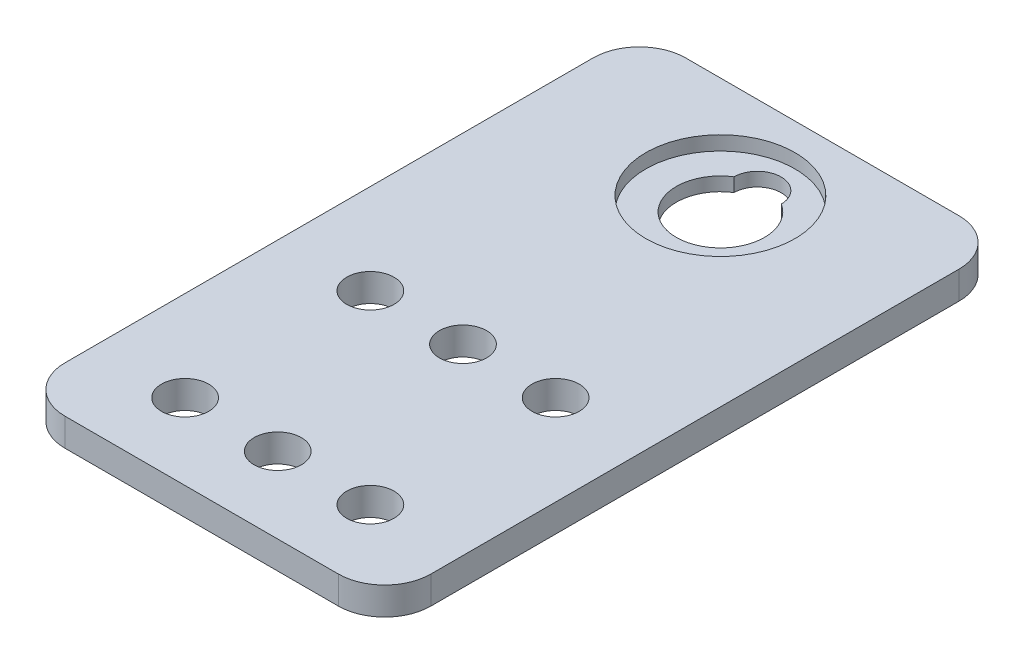
ISO-10303-21;
HEADER;
FILE_DESCRIPTION(('STEP AP214'),'2;1');
FILE_NAME('part.step','',(''),(''),'','','');
FILE_SCHEMA(('AUTOMOTIVE_DESIGN { 1 0 10303 214 1 1 1 1 }'));
ENDSEC;
DATA;
#1=APPLICATION_CONTEXT('core data for automotive mechanical design processes');
#2=APPLICATION_PROTOCOL_DEFINITION('international standard','automotive_design',2000,#1);
#3=PRODUCT_CONTEXT('',#1,'mechanical');
#4=PRODUCT('Part','Part','',(#3));
#5=PRODUCT_RELATED_PRODUCT_CATEGORY('part','',(#4));
#6=PRODUCT_DEFINITION_FORMATION('','',#4);
#7=PRODUCT_DEFINITION_CONTEXT('part definition',#1,'design');
#8=PRODUCT_DEFINITION('design','',#6,#7);
#9=PRODUCT_DEFINITION_SHAPE('','',#8);
#10=(LENGTH_UNIT() NAMED_UNIT(*) SI_UNIT(.MILLI.,.METRE.));
#11=(NAMED_UNIT(*) PLANE_ANGLE_UNIT() SI_UNIT($,.RADIAN.));
#12=(NAMED_UNIT(*) SI_UNIT($,.STERADIAN.) SOLID_ANGLE_UNIT());
#13=UNCERTAINTY_MEASURE_WITH_UNIT(LENGTH_MEASURE(1.E-05),#10,'distance_accuracy_value','');
#14=(GEOMETRIC_REPRESENTATION_CONTEXT(3) GLOBAL_UNCERTAINTY_ASSIGNED_CONTEXT((#13)) GLOBAL_UNIT_ASSIGNED_CONTEXT((#10,
#11,#12)) REPRESENTATION_CONTEXT('',''));
#15=CARTESIAN_POINT('',(0.,0.,0.));
#16=DIRECTION('',(0.,0.,1.));
#17=DIRECTION('',(1.,0.,0.));
#18=AXIS2_PLACEMENT_3D('',#15,#16,#17);
#19=CARTESIAN_POINT('',(-14.75,3.,28.5));
#20=DIRECTION('',(0.,-1.,0.));
#21=DIRECTION('',(0.,0.,-1.));
#22=AXIS2_PLACEMENT_3D('',#19,#20,#21);
#23=PLANE('',#22);
#24=CARTESIAN_POINT('',(0.,3.,-22.5));
#25=DIRECTION('',(0.,1.,0.));
#26=DIRECTION('',(0.,0.,1.));
#27=AXIS2_PLACEMENT_3D('',#24,#25,#26);
#28=CIRCLE('',#27,8.0518);
#29=CARTESIAN_POINT('',(0.,3.,-14.4482));
#30=VERTEX_POINT('',#29);
#31=EDGE_CURVE('E454',#30,#30,#28,.T.);
#32=ORIENTED_EDGE('',*,*,#31,.F.);
#33=EDGE_LOOP('',(#32));
#34=FACE_BOUND('',#33,.T.);
#35=CARTESIAN_POINT('',(-14.75,3.,28.5));
#36=DIRECTION('',(0.,1.,0.));
#37=DIRECTION('',(0.,0.,-1.));
#38=AXIS2_PLACEMENT_3D('',#35,#36,#37);
#39=CIRCLE('',#38,5.);
#40=CARTESIAN_POINT('',(-19.75,3.,28.5));
#41=VERTEX_POINT('',#40);
#42=CARTESIAN_POINT('',(-14.75,3.,33.5));
#43=VERTEX_POINT('',#42);
#44=EDGE_CURVE('E172',#41,#43,#39,.T.);
#45=ORIENTED_EDGE('',*,*,#44,.T.);
#46=DIRECTION('',(1.,0.,0.));
#47=VECTOR('',#46,1.);
#48=CARTESIAN_POINT('',(14.75,3.,33.5));
#49=LINE('',#48,#47);
#50=CARTESIAN_POINT('',(14.75,3.,33.5));
#51=VERTEX_POINT('',#50);
#52=EDGE_CURVE('E113',#43,#51,#49,.T.);
#53=ORIENTED_EDGE('',*,*,#52,.T.);
#54=CARTESIAN_POINT('',(14.75,3.,28.5));
#55=DIRECTION('',(0.,1.,0.));
#56=DIRECTION('',(0.,0.,1.));
#57=AXIS2_PLACEMENT_3D('',#54,#55,#56);
#58=CIRCLE('',#57,5.00000000000001);
#59=CARTESIAN_POINT('',(19.75,3.,28.5));
#60=VERTEX_POINT('',#59);
#61=EDGE_CURVE('E252',#51,#60,#58,.T.);
#62=ORIENTED_EDGE('',*,*,#61,.T.);
#63=DIRECTION('',(0.,0.,-1.));
#64=VECTOR('',#63,1.);
#65=CARTESIAN_POINT('',(19.75,3.,28.5));
#66=LINE('',#65,#64);
#67=CARTESIAN_POINT('',(19.75,3.,-28.5));
#68=VERTEX_POINT('',#67);
#69=EDGE_CURVE('E254',#60,#68,#66,.T.);
#70=ORIENTED_EDGE('',*,*,#69,.T.);
#71=CARTESIAN_POINT('',(14.75,3.,-28.5));
#72=DIRECTION('',(0.,1.,0.));
#73=DIRECTION('',(0.,0.,1.));
#74=AXIS2_PLACEMENT_3D('',#71,#72,#73);
#75=CIRCLE('',#74,5.);
#76=CARTESIAN_POINT('',(14.75,3.,-33.5));
#77=VERTEX_POINT('',#76);
#78=EDGE_CURVE('E135',#68,#77,#75,.T.);
#79=ORIENTED_EDGE('',*,*,#78,.T.);
#80=DIRECTION('',(-1.,0.,0.));
#81=VECTOR('',#80,1.);
#82=CARTESIAN_POINT('',(14.75,3.,-33.5));
#83=LINE('',#82,#81);
#84=CARTESIAN_POINT('',(-14.75,3.,-33.5));
#85=VERTEX_POINT('',#84);
#86=EDGE_CURVE('E128',#77,#85,#83,.T.);
#87=ORIENTED_EDGE('',*,*,#86,.T.);
#88=CARTESIAN_POINT('',(-14.75,3.,-28.5));
#89=DIRECTION('',(0.,1.,0.));
#90=DIRECTION('',(0.,0.,1.));
#91=AXIS2_PLACEMENT_3D('',#88,#89,#90);
#92=CIRCLE('',#91,5.);
#93=CARTESIAN_POINT('',(-19.75,3.,-28.5));
#94=VERTEX_POINT('',#93);
#95=EDGE_CURVE('E132',#85,#94,#92,.T.);
#96=ORIENTED_EDGE('',*,*,#95,.T.);
#97=DIRECTION('',(0.,0.,1.));
#98=VECTOR('',#97,1.);
#99=CARTESIAN_POINT('',(-19.75,3.,28.5));
#100=LINE('',#99,#98);
#101=EDGE_CURVE('E71',#94,#41,#100,.T.);
#102=ORIENTED_EDGE('',*,*,#101,.T.);
#103=EDGE_LOOP('',(#45,#53,#62,#70,#79,#87,#96,#102));
#104=FACE_BOUND('',#103,.T.);
#105=CARTESIAN_POINT('',(10.,3.,25.29));
#106=DIRECTION('',(0.,1.,0.));
#107=DIRECTION('',(0.,0.,1.));
#108=AXIS2_PLACEMENT_3D('',#105,#106,#107);
#109=CIRCLE('',#108,2.55);
#110=CARTESIAN_POINT('',(10.,3.,27.84));
#111=VERTEX_POINT('',#110);
#112=EDGE_CURVE('E244',#111,#111,#109,.T.);
#113=ORIENTED_EDGE('',*,*,#112,.F.);
#114=EDGE_LOOP('',(#113));
#115=FACE_BOUND('',#114,.T.);
#116=CARTESIAN_POINT('',(10.,3.,5.29));
#117=DIRECTION('',(0.,1.,0.));
#118=DIRECTION('',(0.,0.,1.));
#119=AXIS2_PLACEMENT_3D('',#116,#117,#118);
#120=CIRCLE('',#119,2.55);
#121=CARTESIAN_POINT('',(10.,3.,7.84));
#122=VERTEX_POINT('',#121);
#123=EDGE_CURVE('E238',#122,#122,#120,.T.);
#124=ORIENTED_EDGE('',*,*,#123,.F.);
#125=EDGE_LOOP('',(#124));
#126=FACE_BOUND('',#125,.T.);
#127=CARTESIAN_POINT('',(0.,3.,25.29));
#128=DIRECTION('',(0.,1.,0.));
#129=DIRECTION('',(0.,0.,1.));
#130=AXIS2_PLACEMENT_3D('',#127,#128,#129);
#131=CIRCLE('',#130,2.55);
#132=CARTESIAN_POINT('',(0.,3.,27.84));
#133=VERTEX_POINT('',#132);
#134=EDGE_CURVE('E232',#133,#133,#131,.T.);
#135=ORIENTED_EDGE('',*,*,#134,.F.);
#136=EDGE_LOOP('',(#135));
#137=FACE_BOUND('',#136,.T.);
#138=CARTESIAN_POINT('',(0.,3.,5.29));
#139=DIRECTION('',(0.,1.,0.));
#140=DIRECTION('',(0.,0.,1.));
#141=AXIS2_PLACEMENT_3D('',#138,#139,#140);
#142=CIRCLE('',#141,2.55);
#143=CARTESIAN_POINT('',(0.,3.,7.84));
#144=VERTEX_POINT('',#143);
#145=EDGE_CURVE('E226',#144,#144,#142,.T.);
#146=ORIENTED_EDGE('',*,*,#145,.F.);
#147=EDGE_LOOP('',(#146));
#148=FACE_BOUND('',#147,.T.);
#149=CARTESIAN_POINT('',(-9.99999999999999,3.,25.29));
#150=DIRECTION('',(0.,1.,0.));
#151=DIRECTION('',(0.,0.,1.));
#152=AXIS2_PLACEMENT_3D('',#149,#150,#151);
#153=CIRCLE('',#152,2.55);
#154=CARTESIAN_POINT('',(-9.99999999999999,3.,27.84));
#155=VERTEX_POINT('',#154);
#156=EDGE_CURVE('E220',#155,#155,#153,.T.);
#157=ORIENTED_EDGE('',*,*,#156,.F.);
#158=EDGE_LOOP('',(#157));
#159=FACE_BOUND('',#158,.T.);
#160=CARTESIAN_POINT('',(-9.99999999999999,3.,5.29));
#161=DIRECTION('',(0.,1.,0.));
#162=DIRECTION('',(0.,0.,1.));
#163=AXIS2_PLACEMENT_3D('',#160,#161,#162);
#164=CIRCLE('',#163,2.55);
#165=CARTESIAN_POINT('',(-9.99999999999999,3.,7.84));
#166=VERTEX_POINT('',#165);
#167=EDGE_CURVE('E211',#166,#166,#164,.T.);
#168=ORIENTED_EDGE('',*,*,#167,.F.);
#169=EDGE_LOOP('',(#168));
#170=FACE_BOUND('',#169,.T.);
#171=ADVANCED_FACE('F48',(#34,#104,#115,#126,#137,#148,#159,#170),#23,.F.);
#172=CARTESIAN_POINT('',(-14.75,0.,28.5));
#173=DIRECTION('',(0.,-1.,0.));
#174=DIRECTION('',(0.,0.,-1.));
#175=AXIS2_PLACEMENT_3D('',#172,#173,#174);
#176=PLANE('',#175);
#177=CARTESIAN_POINT('',(0.,0.,-22.5));
#178=DIRECTION('',(0.,1.,0.));
#179=DIRECTION('',(0.,0.,1.));
#180=AXIS2_PLACEMENT_3D('',#177,#178,#179);
#181=CIRCLE('',#180,4.7625);
#182=CARTESIAN_POINT('',(-2.54990193608533,0.,-26.52236328125));
#183=VERTEX_POINT('',#182);
#184=CARTESIAN_POINT('',(2.54990193608533,0.,-26.52236328125));
#185=VERTEX_POINT('',#184);
#186=EDGE_CURVE('E203',#183,#185,#181,.T.);
#187=ORIENTED_EDGE('',*,*,#186,.T.);
#188=CARTESIAN_POINT('',(0.,0.,-26.5));
#189=DIRECTION('',(0.,1.,0.));
#190=DIRECTION('',(0.,0.,1.));
#191=AXIS2_PLACEMENT_3D('',#188,#189,#190);
#192=CIRCLE('',#191,2.55);
#193=EDGE_CURVE('E160',#185,#183,#192,.T.);
#194=ORIENTED_EDGE('',*,*,#193,.T.);
#195=EDGE_LOOP('',(#187,#194));
#196=FACE_BOUND('',#195,.T.);
#197=CARTESIAN_POINT('',(-9.99999999999999,0.,25.29));
#198=DIRECTION('',(0.,1.,0.));
#199=DIRECTION('',(0.,0.,1.));
#200=AXIS2_PLACEMENT_3D('',#197,#198,#199);
#201=CIRCLE('',#200,2.55);
#202=CARTESIAN_POINT('',(-9.99999999999999,0.,27.84));
#203=VERTEX_POINT('',#202);
#204=EDGE_CURVE('E218',#203,#203,#201,.T.);
#205=ORIENTED_EDGE('',*,*,#204,.T.);
#206=EDGE_LOOP('',(#205));
#207=FACE_BOUND('',#206,.T.);
#208=CARTESIAN_POINT('',(0.,0.,25.29));
#209=DIRECTION('',(0.,1.,0.));
#210=DIRECTION('',(0.,0.,1.));
#211=AXIS2_PLACEMENT_3D('',#208,#209,#210);
#212=CIRCLE('',#211,2.55);
#213=CARTESIAN_POINT('',(0.,0.,27.84));
#214=VERTEX_POINT('',#213);
#215=EDGE_CURVE('E229',#214,#214,#212,.T.);
#216=ORIENTED_EDGE('',*,*,#215,.T.);
#217=EDGE_LOOP('',(#216));
#218=FACE_BOUND('',#217,.T.);
#219=CARTESIAN_POINT('',(10.,0.,25.29));
#220=DIRECTION('',(0.,1.,0.));
#221=DIRECTION('',(0.,0.,1.));
#222=AXIS2_PLACEMENT_3D('',#219,#220,#221);
#223=CIRCLE('',#222,2.55);
#224=CARTESIAN_POINT('',(10.,0.,27.84));
#225=VERTEX_POINT('',#224);
#226=EDGE_CURVE('E241',#225,#225,#223,.T.);
#227=ORIENTED_EDGE('',*,*,#226,.T.);
#228=EDGE_LOOP('',(#227));
#229=FACE_BOUND('',#228,.T.);
#230=CARTESIAN_POINT('',(-14.75,0.,28.5));
#231=DIRECTION('',(0.,1.,0.));
#232=DIRECTION('',(0.,0.,-1.));
#233=AXIS2_PLACEMENT_3D('',#230,#231,#232);
#234=CIRCLE('',#233,5.);
#235=CARTESIAN_POINT('',(-19.75,0.,28.5));
#236=VERTEX_POINT('',#235);
#237=CARTESIAN_POINT('',(-14.75,0.,33.5));
#238=VERTEX_POINT('',#237);
#239=EDGE_CURVE('E156',#236,#238,#234,.T.);
#240=ORIENTED_EDGE('',*,*,#239,.F.);
#241=DIRECTION('',(0.,0.,1.));
#242=VECTOR('',#241,1.);
#243=CARTESIAN_POINT('',(-19.75,0.,28.5));
#244=LINE('',#243,#242);
#245=CARTESIAN_POINT('',(-19.75,0.,-28.5));
#246=VERTEX_POINT('',#245);
#247=EDGE_CURVE('E104',#246,#236,#244,.T.);
#248=ORIENTED_EDGE('',*,*,#247,.F.);
#249=CARTESIAN_POINT('',(-14.75,0.,-28.5));
#250=DIRECTION('',(0.,1.,0.));
#251=DIRECTION('',(0.,0.,1.));
#252=AXIS2_PLACEMENT_3D('',#249,#250,#251);
#253=CIRCLE('',#252,5.);
#254=CARTESIAN_POINT('',(-14.75,0.,-33.5));
#255=VERTEX_POINT('',#254);
#256=EDGE_CURVE('E169',#255,#246,#253,.T.);
#257=ORIENTED_EDGE('',*,*,#256,.F.);
#258=DIRECTION('',(-1.,0.,0.));
#259=VECTOR('',#258,1.);
#260=CARTESIAN_POINT('',(14.75,0.,-33.5));
#261=LINE('',#260,#259);
#262=CARTESIAN_POINT('',(14.75,0.,-33.5));
#263=VERTEX_POINT('',#262);
#264=EDGE_CURVE('E144',#263,#255,#261,.T.);
#265=ORIENTED_EDGE('',*,*,#264,.F.);
#266=CARTESIAN_POINT('',(14.75,0.,-28.5));
#267=DIRECTION('',(0.,1.,0.));
#268=DIRECTION('',(0.,0.,1.));
#269=AXIS2_PLACEMENT_3D('',#266,#267,#268);
#270=CIRCLE('',#269,5.);
#271=CARTESIAN_POINT('',(19.75,0.,-28.5));
#272=VERTEX_POINT('',#271);
#273=EDGE_CURVE('E166',#272,#263,#270,.T.);
#274=ORIENTED_EDGE('',*,*,#273,.F.);
#275=DIRECTION('',(0.,0.,-1.));
#276=VECTOR('',#275,1.);
#277=CARTESIAN_POINT('',(19.75,0.,28.5));
#278=LINE('',#277,#276);
#279=CARTESIAN_POINT('',(19.75,0.,28.5));
#280=VERTEX_POINT('',#279);
#281=EDGE_CURVE('E164',#280,#272,#278,.T.);
#282=ORIENTED_EDGE('',*,*,#281,.F.);
#283=CARTESIAN_POINT('',(14.75,0.,28.5));
#284=DIRECTION('',(0.,1.,0.));
#285=DIRECTION('',(0.,0.,1.));
#286=AXIS2_PLACEMENT_3D('',#283,#284,#285);
#287=CIRCLE('',#286,5.00000000000001);
#288=CARTESIAN_POINT('',(14.75,0.,33.5));
#289=VERTEX_POINT('',#288);
#290=EDGE_CURVE('E162',#289,#280,#287,.T.);
#291=ORIENTED_EDGE('',*,*,#290,.F.);
#292=DIRECTION('',(1.,0.,0.));
#293=VECTOR('',#292,1.);
#294=CARTESIAN_POINT('',(14.75,0.,33.5));
#295=LINE('',#294,#293);
#296=EDGE_CURVE('E159',#238,#289,#295,.T.);
#297=ORIENTED_EDGE('',*,*,#296,.F.);
#298=EDGE_LOOP('',(#240,#248,#257,#265,#274,#282,#291,#297));
#299=FACE_BOUND('',#298,.T.);
#300=CARTESIAN_POINT('',(10.,0.,5.29));
#301=DIRECTION('',(0.,1.,0.));
#302=DIRECTION('',(0.,0.,1.));
#303=AXIS2_PLACEMENT_3D('',#300,#301,#302);
#304=CIRCLE('',#303,2.55);
#305=CARTESIAN_POINT('',(10.,0.,7.84));
#306=VERTEX_POINT('',#305);
#307=EDGE_CURVE('E235',#306,#306,#304,.T.);
#308=ORIENTED_EDGE('',*,*,#307,.T.);
#309=EDGE_LOOP('',(#308));
#310=FACE_BOUND('',#309,.T.);
#311=CARTESIAN_POINT('',(0.,0.,5.29));
#312=DIRECTION('',(0.,1.,0.));
#313=DIRECTION('',(0.,0.,1.));
#314=AXIS2_PLACEMENT_3D('',#311,#312,#313);
#315=CIRCLE('',#314,2.55);
#316=CARTESIAN_POINT('',(0.,0.,7.84));
#317=VERTEX_POINT('',#316);
#318=EDGE_CURVE('E223',#317,#317,#315,.T.);
#319=ORIENTED_EDGE('',*,*,#318,.T.);
#320=EDGE_LOOP('',(#319));
#321=FACE_BOUND('',#320,.T.);
#322=CARTESIAN_POINT('',(-9.99999999999999,0.,5.29));
#323=DIRECTION('',(0.,1.,0.));
#324=DIRECTION('',(0.,0.,1.));
#325=AXIS2_PLACEMENT_3D('',#322,#323,#324);
#326=CIRCLE('',#325,2.55);
#327=CARTESIAN_POINT('',(-9.99999999999999,0.,7.84));
#328=VERTEX_POINT('',#327);
#329=EDGE_CURVE('E208',#328,#328,#326,.T.);
#330=ORIENTED_EDGE('',*,*,#329,.T.);
#331=EDGE_LOOP('',(#330));
#332=FACE_BOUND('',#331,.T.);
#333=ADVANCED_FACE('F206',(#196,#207,#218,#229,#299,#310,#321,#332),#176,.T.);
#334=CARTESIAN_POINT('',(-14.75,3.,28.5));
#335=DIRECTION('',(0.,-1.,0.));
#336=DIRECTION('',(0.,0.,-1.));
#337=AXIS2_PLACEMENT_3D('',#334,#335,#336);
#338=CYLINDRICAL_SURFACE('',#337,5.);
#339=ORIENTED_EDGE('',*,*,#239,.T.);
#340=DIRECTION('',(0.,-1.,0.));
#341=VECTOR('',#340,1.);
#342=CARTESIAN_POINT('',(-14.75,3.,33.5));
#343=LINE('',#342,#341);
#344=EDGE_CURVE('E185',#43,#238,#343,.T.);
#345=ORIENTED_EDGE('',*,*,#344,.F.);
#346=ORIENTED_EDGE('',*,*,#44,.F.);
#347=DIRECTION('',(0.,-1.,0.));
#348=VECTOR('',#347,1.);
#349=CARTESIAN_POINT('',(-19.75,3.,28.5));
#350=LINE('',#349,#348);
#351=EDGE_CURVE('E152',#41,#236,#350,.T.);
#352=ORIENTED_EDGE('',*,*,#351,.T.);
#353=EDGE_LOOP('',(#339,#345,#346,#352));
#354=FACE_BOUND('',#353,.T.);
#355=ADVANCED_FACE('F50',(#354),#338,.T.);
#356=CARTESIAN_POINT('',(14.75,3.,33.5));
#357=DIRECTION('',(0.,0.,-1.));
#358=DIRECTION('',(-1.,0.,0.));
#359=AXIS2_PLACEMENT_3D('',#356,#357,#358);
#360=PLANE('',#359);
#361=ORIENTED_EDGE('',*,*,#296,.T.);
#362=DIRECTION('',(0.,-1.,0.));
#363=VECTOR('',#362,1.);
#364=CARTESIAN_POINT('',(14.75,3.,33.5));
#365=LINE('',#364,#363);
#366=EDGE_CURVE('E182',#51,#289,#365,.T.);
#367=ORIENTED_EDGE('',*,*,#366,.F.);
#368=ORIENTED_EDGE('',*,*,#52,.F.);
#369=ORIENTED_EDGE('',*,*,#344,.T.);
#370=EDGE_LOOP('',(#361,#367,#368,#369));
#371=FACE_BOUND('',#370,.T.);
#372=ADVANCED_FACE('F272',(#371),#360,.F.);
#373=CARTESIAN_POINT('',(14.75,3.,28.5));
#374=DIRECTION('',(0.,-1.,0.));
#375=DIRECTION('',(0.,0.,-1.));
#376=AXIS2_PLACEMENT_3D('',#373,#374,#375);
#377=CYLINDRICAL_SURFACE('',#376,5.00000000000001);
#378=ORIENTED_EDGE('',*,*,#290,.T.);
#379=DIRECTION('',(0.,-1.,0.));
#380=VECTOR('',#379,1.);
#381=CARTESIAN_POINT('',(19.75,3.,28.5));
#382=LINE('',#381,#380);
#383=EDGE_CURVE('E179',#60,#280,#382,.T.);
#384=ORIENTED_EDGE('',*,*,#383,.F.);
#385=ORIENTED_EDGE('',*,*,#61,.F.);
#386=ORIENTED_EDGE('',*,*,#366,.T.);
#387=EDGE_LOOP('',(#378,#384,#385,#386));
#388=FACE_BOUND('',#387,.T.);
#389=ADVANCED_FACE('F275',(#388),#377,.T.);
#390=CARTESIAN_POINT('',(19.75,3.,28.5));
#391=DIRECTION('',(-1.,0.,0.));
#392=DIRECTION('',(0.,0.,1.));
#393=AXIS2_PLACEMENT_3D('',#390,#391,#392);
#394=PLANE('',#393);
#395=ORIENTED_EDGE('',*,*,#281,.T.);
#396=DIRECTION('',(0.,-1.,0.));
#397=VECTOR('',#396,1.);
#398=CARTESIAN_POINT('',(19.75,3.,-28.5));
#399=LINE('',#398,#397);
#400=EDGE_CURVE('E176',#68,#272,#399,.T.);
#401=ORIENTED_EDGE('',*,*,#400,.F.);
#402=ORIENTED_EDGE('',*,*,#69,.F.);
#403=ORIENTED_EDGE('',*,*,#383,.T.);
#404=EDGE_LOOP('',(#395,#401,#402,#403));
#405=FACE_BOUND('',#404,.T.);
#406=ADVANCED_FACE('F260',(#405),#394,.F.);
#407=CARTESIAN_POINT('',(14.75,3.,-28.5));
#408=DIRECTION('',(0.,-1.,0.));
#409=DIRECTION('',(0.,0.,-1.));
#410=AXIS2_PLACEMENT_3D('',#407,#408,#409);
#411=CYLINDRICAL_SURFACE('',#410,5.);
#412=ORIENTED_EDGE('',*,*,#273,.T.);
#413=DIRECTION('',(0.,-1.,0.));
#414=VECTOR('',#413,1.);
#415=CARTESIAN_POINT('',(14.75,3.,-33.5));
#416=LINE('',#415,#414);
#417=EDGE_CURVE('E147',#77,#263,#416,.T.);
#418=ORIENTED_EDGE('',*,*,#417,.F.);
#419=ORIENTED_EDGE('',*,*,#78,.F.);
#420=ORIENTED_EDGE('',*,*,#400,.T.);
#421=EDGE_LOOP('',(#412,#418,#419,#420));
#422=FACE_BOUND('',#421,.T.);
#423=ADVANCED_FACE('F264',(#422),#411,.T.);
#424=CARTESIAN_POINT('',(14.75,3.,-33.5));
#425=DIRECTION('',(0.,0.,1.));
#426=DIRECTION('',(1.,0.,0.));
#427=AXIS2_PLACEMENT_3D('',#424,#425,#426);
#428=PLANE('',#427);
#429=ORIENTED_EDGE('',*,*,#264,.T.);
#430=DIRECTION('',(0.,-1.,0.));
#431=VECTOR('',#430,1.);
#432=CARTESIAN_POINT('',(-14.75,3.,-33.5));
#433=LINE('',#432,#431);
#434=EDGE_CURVE('E141',#85,#255,#433,.T.);
#435=ORIENTED_EDGE('',*,*,#434,.F.);
#436=ORIENTED_EDGE('',*,*,#86,.F.);
#437=ORIENTED_EDGE('',*,*,#417,.T.);
#438=EDGE_LOOP('',(#429,#435,#436,#437));
#439=FACE_BOUND('',#438,.T.);
#440=ADVANCED_FACE('F142',(#439),#428,.F.);
#441=CARTESIAN_POINT('',(-14.75,3.,-28.5));
#442=DIRECTION('',(0.,-1.,0.));
#443=DIRECTION('',(0.,0.,-1.));
#444=AXIS2_PLACEMENT_3D('',#441,#442,#443);
#445=CYLINDRICAL_SURFACE('',#444,5.);
#446=ORIENTED_EDGE('',*,*,#256,.T.);
#447=DIRECTION('',(0.,-1.,0.));
#448=VECTOR('',#447,1.);
#449=CARTESIAN_POINT('',(-19.75,3.,-28.5));
#450=LINE('',#449,#448);
#451=EDGE_CURVE('E148',#94,#246,#450,.T.);
#452=ORIENTED_EDGE('',*,*,#451,.F.);
#453=ORIENTED_EDGE('',*,*,#95,.F.);
#454=ORIENTED_EDGE('',*,*,#434,.T.);
#455=EDGE_LOOP('',(#446,#452,#453,#454));
#456=FACE_BOUND('',#455,.T.);
#457=ADVANCED_FACE('F150',(#456),#445,.T.);
#458=CARTESIAN_POINT('',(-19.75,3.,28.5));
#459=DIRECTION('',(1.,0.,0.));
#460=DIRECTION('',(0.,0.,-1.));
#461=AXIS2_PLACEMENT_3D('',#458,#459,#460);
#462=PLANE('',#461);
#463=ORIENTED_EDGE('',*,*,#247,.T.);
#464=ORIENTED_EDGE('',*,*,#351,.F.);
#465=ORIENTED_EDGE('',*,*,#101,.F.);
#466=ORIENTED_EDGE('',*,*,#451,.T.);
#467=EDGE_LOOP('',(#463,#464,#465,#466));
#468=FACE_BOUND('',#467,.T.);
#469=ADVANCED_FACE('F268',(#468),#462,.F.);
#470=CARTESIAN_POINT('',(0.,3.,-26.5));
#471=DIRECTION('',(0.,-1.,0.));
#472=DIRECTION('',(0.,0.,-1.));
#473=AXIS2_PLACEMENT_3D('',#470,#471,#472);
#474=CYLINDRICAL_SURFACE('',#473,2.55);
#475=DIRECTION('',(0.,1.,0.));
#476=VECTOR('',#475,1.);
#477=CARTESIAN_POINT('',(-2.54990193608533,0.738000000000001,-26.52236328125));
#478=LINE('',#477,#476);
#479=CARTESIAN_POINT('',(-2.54990193608533,1.476,-26.52236328125));
#480=VERTEX_POINT('',#479);
#481=EDGE_CURVE('E13',#183,#480,#478,.T.);
#482=ORIENTED_EDGE('',*,*,#481,.F.);
#483=ORIENTED_EDGE('',*,*,#193,.F.);
#484=DIRECTION('',(0.,1.,0.));
#485=VECTOR('',#484,1.);
#486=CARTESIAN_POINT('',(2.54990193608533,0.738000000000001,-26.52236328125));
#487=LINE('',#486,#485);
#488=CARTESIAN_POINT('',(2.54990193608533,1.476,-26.52236328125));
#489=VERTEX_POINT('',#488);
#490=EDGE_CURVE('E187',#489,#185,#487,.F.);
#491=ORIENTED_EDGE('',*,*,#490,.F.);
#492=CARTESIAN_POINT('',(0.,1.476,-26.5));
#493=DIRECTION('',(0.,-1.,0.));
#494=DIRECTION('',(0.,0.,-1.));
#495=AXIS2_PLACEMENT_3D('',#492,#493,#494);
#496=CIRCLE('',#495,2.55);
#497=EDGE_CURVE('E56',#480,#489,#496,.T.);
#498=ORIENTED_EDGE('',*,*,#497,.F.);
#499=EDGE_LOOP('',(#482,#483,#491,#498));
#500=FACE_BOUND('',#499,.T.);
#501=ADVANCED_FACE('F196',(#500),#474,.F.);
#502=CARTESIAN_POINT('',(10.,3.,25.29));
#503=DIRECTION('',(0.,-1.,0.));
#504=DIRECTION('',(0.,0.,-1.));
#505=AXIS2_PLACEMENT_3D('',#502,#503,#504);
#506=CYLINDRICAL_SURFACE('',#505,2.55);
#507=ORIENTED_EDGE('',*,*,#112,.T.);
#508=EDGE_LOOP('',(#507));
#509=FACE_BOUND('',#508,.T.);
#510=ORIENTED_EDGE('',*,*,#226,.F.);
#511=EDGE_LOOP('',(#510));
#512=FACE_BOUND('',#511,.T.);
#513=ADVANCED_FACE('F324',(#509,#512),#506,.F.);
#514=CARTESIAN_POINT('',(10.,3.,5.29));
#515=DIRECTION('',(0.,-1.,0.));
#516=DIRECTION('',(0.,0.,-1.));
#517=AXIS2_PLACEMENT_3D('',#514,#515,#516);
#518=CYLINDRICAL_SURFACE('',#517,2.55);
#519=ORIENTED_EDGE('',*,*,#123,.T.);
#520=EDGE_LOOP('',(#519));
#521=FACE_BOUND('',#520,.T.);
#522=ORIENTED_EDGE('',*,*,#307,.F.);
#523=EDGE_LOOP('',(#522));
#524=FACE_BOUND('',#523,.T.);
#525=ADVANCED_FACE('F331',(#521,#524),#518,.F.);
#526=CARTESIAN_POINT('',(0.,3.,25.29));
#527=DIRECTION('',(0.,-1.,0.));
#528=DIRECTION('',(0.,0.,-1.));
#529=AXIS2_PLACEMENT_3D('',#526,#527,#528);
#530=CYLINDRICAL_SURFACE('',#529,2.55);
#531=ORIENTED_EDGE('',*,*,#134,.T.);
#532=EDGE_LOOP('',(#531));
#533=FACE_BOUND('',#532,.T.);
#534=ORIENTED_EDGE('',*,*,#215,.F.);
#535=EDGE_LOOP('',(#534));
#536=FACE_BOUND('',#535,.T.);
#537=ADVANCED_FACE('F338',(#533,#536),#530,.F.);
#538=CARTESIAN_POINT('',(0.,3.,5.29));
#539=DIRECTION('',(0.,-1.,0.));
#540=DIRECTION('',(0.,0.,-1.));
#541=AXIS2_PLACEMENT_3D('',#538,#539,#540);
#542=CYLINDRICAL_SURFACE('',#541,2.55);
#543=ORIENTED_EDGE('',*,*,#145,.T.);
#544=EDGE_LOOP('',(#543));
#545=FACE_BOUND('',#544,.T.);
#546=ORIENTED_EDGE('',*,*,#318,.F.);
#547=EDGE_LOOP('',(#546));
#548=FACE_BOUND('',#547,.T.);
#549=ADVANCED_FACE('F346',(#545,#548),#542,.F.);
#550=CARTESIAN_POINT('',(-9.99999999999999,3.,25.29));
#551=DIRECTION('',(0.,-1.,0.));
#552=DIRECTION('',(0.,0.,-1.));
#553=AXIS2_PLACEMENT_3D('',#550,#551,#552);
#554=CYLINDRICAL_SURFACE('',#553,2.55);
#555=ORIENTED_EDGE('',*,*,#156,.T.);
#556=EDGE_LOOP('',(#555));
#557=FACE_BOUND('',#556,.T.);
#558=ORIENTED_EDGE('',*,*,#204,.F.);
#559=EDGE_LOOP('',(#558));
#560=FACE_BOUND('',#559,.T.);
#561=ADVANCED_FACE('F354',(#557,#560),#554,.F.);
#562=CARTESIAN_POINT('',(-9.99999999999999,3.,5.29));
#563=DIRECTION('',(0.,-1.,0.));
#564=DIRECTION('',(0.,0.,-1.));
#565=AXIS2_PLACEMENT_3D('',#562,#563,#564);
#566=CYLINDRICAL_SURFACE('',#565,2.55);
#567=ORIENTED_EDGE('',*,*,#167,.T.);
#568=EDGE_LOOP('',(#567));
#569=FACE_BOUND('',#568,.T.);
#570=ORIENTED_EDGE('',*,*,#329,.F.);
#571=EDGE_LOOP('',(#570));
#572=FACE_BOUND('',#571,.T.);
#573=ADVANCED_FACE('F362',(#569,#572),#566,.F.);
#574=CARTESIAN_POINT('',(0.,3.,-22.5));
#575=DIRECTION('',(0.,1.,0.));
#576=DIRECTION('',(0.,0.,1.));
#577=AXIS2_PLACEMENT_3D('',#574,#575,#576);
#578=CYLINDRICAL_SURFACE('',#577,4.7625);
#579=ORIENTED_EDGE('',*,*,#481,.T.);
#580=CARTESIAN_POINT('',(0.,1.476,-22.5));
#581=DIRECTION('',(0.,1.,0.));
#582=DIRECTION('',(0.,0.,1.));
#583=AXIS2_PLACEMENT_3D('',#580,#581,#582);
#584=CIRCLE('',#583,4.7625);
#585=EDGE_CURVE('E62',#480,#489,#584,.T.);
#586=ORIENTED_EDGE('',*,*,#585,.T.);
#587=ORIENTED_EDGE('',*,*,#490,.T.);
#588=ORIENTED_EDGE('',*,*,#186,.F.);
#589=EDGE_LOOP('',(#579,#586,#587,#588));
#590=FACE_BOUND('',#589,.T.);
#591=ADVANCED_FACE('F201',(#590),#578,.F.);
#592=CARTESIAN_POINT('',(4.7625,1.476,-22.5));
#593=DIRECTION('',(0.,-1.,0.));
#594=DIRECTION('',(0.,0.,-1.));
#595=AXIS2_PLACEMENT_3D('',#592,#593,#594);
#596=PLANE('',#595);
#597=ORIENTED_EDGE('',*,*,#497,.T.);
#598=ORIENTED_EDGE('',*,*,#585,.F.);
#599=EDGE_LOOP('',(#597,#598));
#600=FACE_BOUND('',#599,.T.);
#601=CARTESIAN_POINT('',(0.,1.476,-22.5));
#602=DIRECTION('',(0.,1.,0.));
#603=DIRECTION('',(0.,0.,1.));
#604=AXIS2_PLACEMENT_3D('',#601,#602,#603);
#605=CIRCLE('',#604,8.0518);
#606=CARTESIAN_POINT('',(0.,1.476,-14.4482));
#607=VERTEX_POINT('',#606);
#608=EDGE_CURVE('E213',#607,#607,#605,.T.);
#609=ORIENTED_EDGE('',*,*,#608,.T.);
#610=EDGE_LOOP('',(#609));
#611=FACE_BOUND('',#610,.T.);
#612=ADVANCED_FACE('F191',(#600,#611),#596,.F.);
#613=CARTESIAN_POINT('',(0.,3.,-22.5));
#614=DIRECTION('',(0.,1.,0.));
#615=DIRECTION('',(0.,0.,1.));
#616=AXIS2_PLACEMENT_3D('',#613,#614,#615);
#617=CYLINDRICAL_SURFACE('',#616,8.0518);
#618=ORIENTED_EDGE('',*,*,#608,.F.);
#619=EDGE_LOOP('',(#618));
#620=FACE_BOUND('',#619,.T.);
#621=ORIENTED_EDGE('',*,*,#31,.T.);
#622=EDGE_LOOP('',(#621));
#623=FACE_BOUND('',#622,.T.);
#624=ADVANCED_FACE('F382',(#620,#623),#617,.F.);
#625=CLOSED_SHELL('',(#171,#333,#355,#372,#389,#406,#423,#440,#457,#469,#501,#513,#525,#537,
#549,#561,#573,#591,#612,#624));
#626=MANIFOLD_SOLID_BREP('B2',#625);
#627=ADVANCED_BREP_SHAPE_REPRESENTATION('',(#18,#626),#14);
#628=SHAPE_DEFINITION_REPRESENTATION(#9,#627);
ENDSEC;
END-ISO-10303-21;
